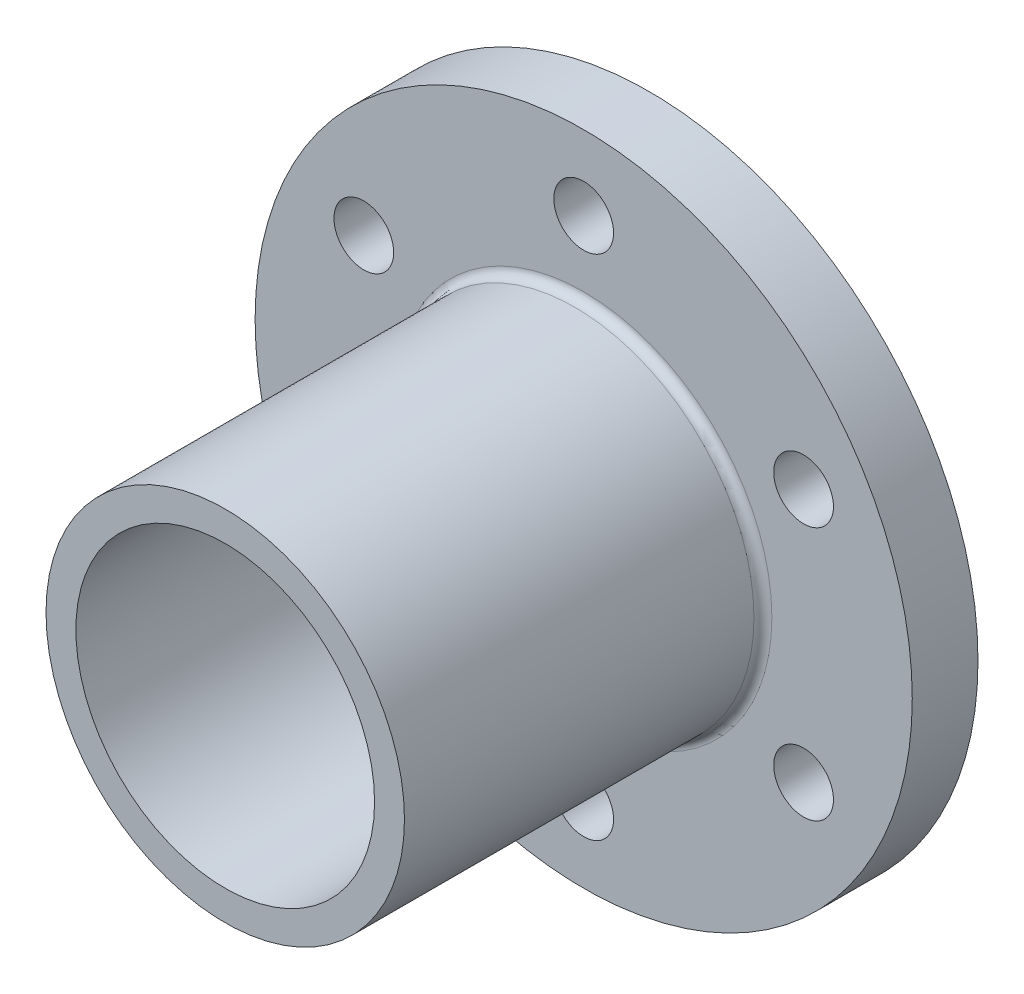
ISO-10303-21;
HEADER;
FILE_DESCRIPTION(('STEP AP214'),'2;1');
FILE_NAME('part.step','',(''),(''),'','','');
FILE_SCHEMA(('AUTOMOTIVE_DESIGN { 1 0 10303 214 1 1 1 1 }'));
ENDSEC;
DATA;
#1=APPLICATION_CONTEXT('core data for automotive mechanical design processes');
#2=APPLICATION_PROTOCOL_DEFINITION('international standard','automotive_design',2000,#1);
#3=PRODUCT_CONTEXT('',#1,'mechanical');
#4=PRODUCT('Part','Part','',(#3));
#5=PRODUCT_RELATED_PRODUCT_CATEGORY('part','',(#4));
#6=PRODUCT_DEFINITION_FORMATION('','',#4);
#7=PRODUCT_DEFINITION_CONTEXT('part definition',#1,'design');
#8=PRODUCT_DEFINITION('design','',#6,#7);
#9=PRODUCT_DEFINITION_SHAPE('','',#8);
#10=(LENGTH_UNIT() NAMED_UNIT(*) SI_UNIT(.MILLI.,.METRE.));
#11=(NAMED_UNIT(*) PLANE_ANGLE_UNIT() SI_UNIT($,.RADIAN.));
#12=(NAMED_UNIT(*) SI_UNIT($,.STERADIAN.) SOLID_ANGLE_UNIT());
#13=UNCERTAINTY_MEASURE_WITH_UNIT(LENGTH_MEASURE(1.E-05),#10,'distance_accuracy_value','');
#14=(GEOMETRIC_REPRESENTATION_CONTEXT(3) GLOBAL_UNCERTAINTY_ASSIGNED_CONTEXT((#13)) GLOBAL_UNIT_ASSIGNED_CONTEXT((#10,
#11,#12)) REPRESENTATION_CONTEXT('',''));
#15=CARTESIAN_POINT('',(0.,0.,0.));
#16=DIRECTION('',(0.,0.,1.));
#17=DIRECTION('',(1.,0.,0.));
#18=AXIS2_PLACEMENT_3D('',#15,#16,#17);
#19=CARTESIAN_POINT('',(0.,0.,22.));
#20=DIRECTION('',(0.,0.,-1.));
#21=DIRECTION('',(-1.,0.,0.));
#22=AXIS2_PLACEMENT_3D('',#19,#20,#21);
#23=CYLINDRICAL_SURFACE('',#22,110.);
#24=CARTESIAN_POINT('',(0.,0.,22.));
#25=DIRECTION('',(0.,0.,1.));
#26=DIRECTION('',(1.,0.,0.));
#27=AXIS2_PLACEMENT_3D('',#24,#25,#26);
#28=CIRCLE('',#27,110.);
#29=CARTESIAN_POINT('',(110.,0.,22.));
#30=VERTEX_POINT('',#29);
#31=EDGE_CURVE('E43',#30,#30,#28,.T.);
#32=ORIENTED_EDGE('',*,*,#31,.F.);
#33=EDGE_LOOP('',(#32));
#34=FACE_BOUND('',#33,.T.);
#35=CARTESIAN_POINT('',(0.,0.,0.));
#36=DIRECTION('',(0.,0.,1.));
#37=DIRECTION('',(1.,0.,0.));
#38=AXIS2_PLACEMENT_3D('',#35,#36,#37);
#39=CIRCLE('',#38,110.);
#40=CARTESIAN_POINT('',(110.,0.,0.));
#41=VERTEX_POINT('',#40);
#42=EDGE_CURVE('E47',#41,#41,#39,.T.);
#43=ORIENTED_EDGE('',*,*,#42,.T.);
#44=EDGE_LOOP('',(#43));
#45=FACE_BOUND('',#44,.T.);
#46=ADVANCED_FACE('F32',(#34,#45),#23,.T.);
#47=CARTESIAN_POINT('',(0.,0.,22.));
#48=DIRECTION('',(0.,0.,1.));
#49=DIRECTION('',(1.,0.,0.));
#50=AXIS2_PLACEMENT_3D('',#47,#48,#49);
#51=PLANE('',#50);
#52=CARTESIAN_POINT('',(0.,0.,22.));
#53=DIRECTION('',(0.,0.,1.));
#54=DIRECTION('',(1.,0.,0.));
#55=AXIS2_PLACEMENT_3D('',#52,#53,#54);
#56=CIRCLE('',#55,63.);
#57=CARTESIAN_POINT('',(63.,0.,22.));
#58=VERTEX_POINT('',#57);
#59=EDGE_CURVE('E10',#58,#58,#56,.F.);
#60=ORIENTED_EDGE('',*,*,#59,.T.);
#61=EDGE_LOOP('',(#60));
#62=FACE_BOUND('',#61,.T.);
#63=CARTESIAN_POINT('',(73.6121593216791,42.5000000000031,22.));
#64=DIRECTION('',(0.,0.,1.));
#65=DIRECTION('',(1.,0.,0.));
#66=AXIS2_PLACEMENT_3D('',#63,#64,#65);
#67=CIRCLE('',#66,10.000000000001);
#68=CARTESIAN_POINT('',(83.6121593216801,42.5000000000031,22.));
#69=VERTEX_POINT('',#68);
#70=EDGE_CURVE('E92',#69,#69,#67,.T.);
#71=ORIENTED_EDGE('',*,*,#70,.F.);
#72=EDGE_LOOP('',(#71));
#73=FACE_BOUND('',#72,.T.);
#74=CARTESIAN_POINT('',(73.6121593216827,-42.4999999999969,22.));
#75=DIRECTION('',(0.,0.,1.));
#76=DIRECTION('',(1.,0.,0.));
#77=AXIS2_PLACEMENT_3D('',#74,#75,#76);
#78=CIRCLE('',#77,10.0000000000047);
#79=CARTESIAN_POINT('',(83.6121593216874,-42.4999999999969,22.));
#80=VERTEX_POINT('',#79);
#81=EDGE_CURVE('E86',#80,#80,#78,.T.);
#82=ORIENTED_EDGE('',*,*,#81,.F.);
#83=EDGE_LOOP('',(#82));
#84=FACE_BOUND('',#83,.T.);
#85=CARTESIAN_POINT('',(7.22671690916752E-12,-85.,22.));
#86=DIRECTION('',(0.,0.,1.));
#87=DIRECTION('',(1.,0.,0.));
#88=AXIS2_PLACEMENT_3D('',#85,#86,#87);
#89=CIRCLE('',#88,10.0000000000075);
#90=CARTESIAN_POINT('',(10.0000000000147,-85.,22.));
#91=VERTEX_POINT('',#90);
#92=EDGE_CURVE('E80',#91,#91,#89,.T.);
#93=ORIENTED_EDGE('',*,*,#92,.F.);
#94=EDGE_LOOP('',(#93));
#95=FACE_BOUND('',#94,.T.);
#96=CARTESIAN_POINT('',(-73.6121593216719,-42.5000000000032,22.));
#97=DIRECTION('',(0.,0.,1.));
#98=DIRECTION('',(1.,0.,0.));
#99=AXIS2_PLACEMENT_3D('',#96,#97,#98);
#100=CIRCLE('',#99,10.0000000000069);
#101=CARTESIAN_POINT('',(-63.612159321665,-42.5000000000032,22.));
#102=VERTEX_POINT('',#101);
#103=EDGE_CURVE('E74',#102,#102,#100,.T.);
#104=ORIENTED_EDGE('',*,*,#103,.F.);
#105=EDGE_LOOP('',(#104));
#106=FACE_BOUND('',#105,.T.);
#107=CARTESIAN_POINT('',(-73.6121593216755,42.4999999999968,22.));
#108=DIRECTION('',(0.,0.,1.));
#109=DIRECTION('',(1.,0.,0.));
#110=AXIS2_PLACEMENT_3D('',#107,#108,#109);
#111=CIRCLE('',#110,10.0000000000036);
#112=CARTESIAN_POINT('',(-63.6121593216719,42.4999999999968,22.));
#113=VERTEX_POINT('',#112);
#114=EDGE_CURVE('E68',#113,#113,#111,.T.);
#115=ORIENTED_EDGE('',*,*,#114,.F.);
#116=EDGE_LOOP('',(#115));
#117=FACE_BOUND('',#116,.T.);
#118=CARTESIAN_POINT('',(0.,85.,22.));
#119=DIRECTION('',(0.,0.,1.));
#120=DIRECTION('',(1.,0.,0.));
#121=AXIS2_PLACEMENT_3D('',#118,#119,#120);
#122=CIRCLE('',#121,10.);
#123=CARTESIAN_POINT('',(10.,85.,22.));
#124=VERTEX_POINT('',#123);
#125=EDGE_CURVE('E62',#124,#124,#122,.T.);
#126=ORIENTED_EDGE('',*,*,#125,.F.);
#127=EDGE_LOOP('',(#126));
#128=FACE_BOUND('',#127,.T.);
#129=ORIENTED_EDGE('',*,*,#31,.T.);
#130=EDGE_LOOP('',(#129));
#131=FACE_BOUND('',#130,.T.);
#132=ADVANCED_FACE('F108',(#62,#73,#84,#95,#106,#117,#128,#131),#51,.T.);
#133=CARTESIAN_POINT('',(0.,0.,0.));
#134=DIRECTION('',(0.,0.,1.));
#135=DIRECTION('',(1.,0.,0.));
#136=AXIS2_PLACEMENT_3D('',#133,#134,#135);
#137=PLANE('',#136);
#138=CARTESIAN_POINT('',(73.6121593216791,42.5000000000031,0.));
#139=DIRECTION('',(0.,0.,1.));
#140=DIRECTION('',(1.,0.,0.));
#141=AXIS2_PLACEMENT_3D('',#138,#139,#140);
#142=CIRCLE('',#141,10.000000000001);
#143=CARTESIAN_POINT('',(83.6121593216801,42.5000000000031,0.));
#144=VERTEX_POINT('',#143);
#145=EDGE_CURVE('E65',#144,#144,#142,.T.);
#146=ORIENTED_EDGE('',*,*,#145,.T.);
#147=EDGE_LOOP('',(#146));
#148=FACE_BOUND('',#147,.T.);
#149=CARTESIAN_POINT('',(73.6121593216827,-42.4999999999969,0.));
#150=DIRECTION('',(0.,0.,1.));
#151=DIRECTION('',(1.,0.,0.));
#152=AXIS2_PLACEMENT_3D('',#149,#150,#151);
#153=CIRCLE('',#152,10.0000000000047);
#154=CARTESIAN_POINT('',(83.6121593216874,-42.4999999999969,0.));
#155=VERTEX_POINT('',#154);
#156=EDGE_CURVE('E89',#155,#155,#153,.T.);
#157=ORIENTED_EDGE('',*,*,#156,.T.);
#158=EDGE_LOOP('',(#157));
#159=FACE_BOUND('',#158,.T.);
#160=CARTESIAN_POINT('',(7.22671690916752E-12,-85.,0.));
#161=DIRECTION('',(0.,0.,1.));
#162=DIRECTION('',(1.,0.,0.));
#163=AXIS2_PLACEMENT_3D('',#160,#161,#162);
#164=CIRCLE('',#163,10.0000000000075);
#165=CARTESIAN_POINT('',(10.0000000000147,-85.,0.));
#166=VERTEX_POINT('',#165);
#167=EDGE_CURVE('E83',#166,#166,#164,.T.);
#168=ORIENTED_EDGE('',*,*,#167,.T.);
#169=EDGE_LOOP('',(#168));
#170=FACE_BOUND('',#169,.T.);
#171=CARTESIAN_POINT('',(-73.6121593216719,-42.5000000000032,0.));
#172=DIRECTION('',(0.,0.,1.));
#173=DIRECTION('',(1.,0.,0.));
#174=AXIS2_PLACEMENT_3D('',#171,#172,#173);
#175=CIRCLE('',#174,10.0000000000069);
#176=CARTESIAN_POINT('',(-63.612159321665,-42.5000000000032,0.));
#177=VERTEX_POINT('',#176);
#178=EDGE_CURVE('E77',#177,#177,#175,.T.);
#179=ORIENTED_EDGE('',*,*,#178,.T.);
#180=EDGE_LOOP('',(#179));
#181=FACE_BOUND('',#180,.T.);
#182=CARTESIAN_POINT('',(-73.6121593216755,42.4999999999968,0.));
#183=DIRECTION('',(0.,0.,1.));
#184=DIRECTION('',(1.,0.,0.));
#185=AXIS2_PLACEMENT_3D('',#182,#183,#184);
#186=CIRCLE('',#185,10.0000000000036);
#187=CARTESIAN_POINT('',(-63.6121593216719,42.4999999999968,0.));
#188=VERTEX_POINT('',#187);
#189=EDGE_CURVE('E71',#188,#188,#186,.T.);
#190=ORIENTED_EDGE('',*,*,#189,.T.);
#191=EDGE_LOOP('',(#190));
#192=FACE_BOUND('',#191,.T.);
#193=CARTESIAN_POINT('',(0.,85.,0.));
#194=DIRECTION('',(0.,0.,1.));
#195=DIRECTION('',(1.,0.,0.));
#196=AXIS2_PLACEMENT_3D('',#193,#194,#195);
#197=CIRCLE('',#196,10.);
#198=CARTESIAN_POINT('',(10.,85.,0.));
#199=VERTEX_POINT('',#198);
#200=EDGE_CURVE('E59',#199,#199,#197,.T.);
#201=ORIENTED_EDGE('',*,*,#200,.T.);
#202=EDGE_LOOP('',(#201));
#203=FACE_BOUND('',#202,.T.);
#204=CARTESIAN_POINT('',(0.,0.,0.));
#205=DIRECTION('',(0.,0.,1.));
#206=DIRECTION('',(1.,0.,0.));
#207=AXIS2_PLACEMENT_3D('',#204,#205,#206);
#208=CIRCLE('',#207,50.);
#209=CARTESIAN_POINT('',(50.,0.,0.));
#210=VERTEX_POINT('',#209);
#211=EDGE_CURVE('E55',#210,#210,#208,.T.);
#212=ORIENTED_EDGE('',*,*,#211,.T.);
#213=EDGE_LOOP('',(#212));
#214=FACE_BOUND('',#213,.T.);
#215=ORIENTED_EDGE('',*,*,#42,.F.);
#216=EDGE_LOOP('',(#215));
#217=FACE_BOUND('',#216,.T.);
#218=ADVANCED_FACE('F98',(#148,#159,#170,#181,#192,#203,#214,#217),#137,.F.);
#219=CARTESIAN_POINT('',(0.,0.,142.));
#220=DIRECTION('',(0.,0.,-1.));
#221=DIRECTION('',(-1.,0.,0.));
#222=AXIS2_PLACEMENT_3D('',#219,#220,#221);
#223=CYLINDRICAL_SURFACE('',#222,60.);
#224=CARTESIAN_POINT('',(0.,0.,25.));
#225=DIRECTION('',(0.,0.,1.));
#226=DIRECTION('',(1.,0.,0.));
#227=AXIS2_PLACEMENT_3D('',#224,#225,#226);
#228=CIRCLE('',#227,60.);
#229=CARTESIAN_POINT('',(60.,0.,25.));
#230=VERTEX_POINT('',#229);
#231=EDGE_CURVE('E39',#230,#230,#228,.T.);
#232=ORIENTED_EDGE('',*,*,#231,.T.);
#233=EDGE_LOOP('',(#232));
#234=FACE_BOUND('',#233,.T.);
#235=CARTESIAN_POINT('',(0.,0.,142.));
#236=DIRECTION('',(0.,0.,1.));
#237=DIRECTION('',(1.,0.,0.));
#238=AXIS2_PLACEMENT_3D('',#235,#236,#237);
#239=CIRCLE('',#238,60.);
#240=CARTESIAN_POINT('',(60.,0.,142.));
#241=VERTEX_POINT('',#240);
#242=EDGE_CURVE('E51',#241,#241,#239,.T.);
#243=ORIENTED_EDGE('',*,*,#242,.F.);
#244=EDGE_LOOP('',(#243));
#245=FACE_BOUND('',#244,.T.);
#246=ADVANCED_FACE('F129',(#234,#245),#223,.T.);
#247=CARTESIAN_POINT('',(0.,0.,142.));
#248=DIRECTION('',(0.,0.,1.));
#249=DIRECTION('',(1.,0.,0.));
#250=AXIS2_PLACEMENT_3D('',#247,#248,#249);
#251=PLANE('',#250);
#252=CARTESIAN_POINT('',(0.,0.,142.));
#253=DIRECTION('',(0.,0.,1.));
#254=DIRECTION('',(1.,0.,0.));
#255=AXIS2_PLACEMENT_3D('',#252,#253,#254);
#256=CIRCLE('',#255,50.);
#257=CARTESIAN_POINT('',(50.,0.,142.));
#258=VERTEX_POINT('',#257);
#259=EDGE_CURVE('E56',#258,#258,#256,.T.);
#260=ORIENTED_EDGE('',*,*,#259,.F.);
#261=EDGE_LOOP('',(#260));
#262=FACE_BOUND('',#261,.T.);
#263=ORIENTED_EDGE('',*,*,#242,.T.);
#264=EDGE_LOOP('',(#263));
#265=FACE_BOUND('',#264,.T.);
#266=ADVANCED_FACE('F134',(#262,#265),#251,.T.);
#267=CARTESIAN_POINT('',(0.,0.,0.));
#268=DIRECTION('',(0.,0.,1.));
#269=DIRECTION('',(1.,0.,0.));
#270=AXIS2_PLACEMENT_3D('',#267,#268,#269);
#271=CYLINDRICAL_SURFACE('',#270,50.);
#272=ORIENTED_EDGE('',*,*,#211,.F.);
#273=EDGE_LOOP('',(#272));
#274=FACE_BOUND('',#273,.T.);
#275=ORIENTED_EDGE('',*,*,#259,.T.);
#276=EDGE_LOOP('',(#275));
#277=FACE_BOUND('',#276,.T.);
#278=ADVANCED_FACE('F139',(#274,#277),#271,.F.);
#279=CARTESIAN_POINT('',(0.,85.,0.));
#280=DIRECTION('',(0.,0.,1.));
#281=DIRECTION('',(1.,0.,0.));
#282=AXIS2_PLACEMENT_3D('',#279,#280,#281);
#283=CYLINDRICAL_SURFACE('',#282,10.);
#284=ORIENTED_EDGE('',*,*,#200,.F.);
#285=EDGE_LOOP('',(#284));
#286=FACE_BOUND('',#285,.T.);
#287=ORIENTED_EDGE('',*,*,#125,.T.);
#288=EDGE_LOOP('',(#287));
#289=FACE_BOUND('',#288,.T.);
#290=ADVANCED_FACE('F143',(#286,#289),#283,.F.);
#291=CARTESIAN_POINT('',(-73.6121593216755,42.4999999999968,0.));
#292=DIRECTION('',(0.,0.,1.));
#293=DIRECTION('',(1.,0.,0.));
#294=AXIS2_PLACEMENT_3D('',#291,#292,#293);
#295=CYLINDRICAL_SURFACE('',#294,10.0000000000036);
#296=ORIENTED_EDGE('',*,*,#189,.F.);
#297=EDGE_LOOP('',(#296));
#298=FACE_BOUND('',#297,.T.);
#299=ORIENTED_EDGE('',*,*,#114,.T.);
#300=EDGE_LOOP('',(#299));
#301=FACE_BOUND('',#300,.T.);
#302=ADVANCED_FACE('F147',(#298,#301),#295,.F.);
#303=CARTESIAN_POINT('',(-73.6121593216719,-42.5000000000032,0.));
#304=DIRECTION('',(0.,0.,1.));
#305=DIRECTION('',(1.,0.,0.));
#306=AXIS2_PLACEMENT_3D('',#303,#304,#305);
#307=CYLINDRICAL_SURFACE('',#306,10.0000000000069);
#308=ORIENTED_EDGE('',*,*,#178,.F.);
#309=EDGE_LOOP('',(#308));
#310=FACE_BOUND('',#309,.T.);
#311=ORIENTED_EDGE('',*,*,#103,.T.);
#312=EDGE_LOOP('',(#311));
#313=FACE_BOUND('',#312,.T.);
#314=ADVANCED_FACE('F151',(#310,#313),#307,.F.);
#315=CARTESIAN_POINT('',(7.22671690916752E-12,-85.,0.));
#316=DIRECTION('',(0.,0.,1.));
#317=DIRECTION('',(1.,0.,0.));
#318=AXIS2_PLACEMENT_3D('',#315,#316,#317);
#319=CYLINDRICAL_SURFACE('',#318,10.0000000000075);
#320=ORIENTED_EDGE('',*,*,#167,.F.);
#321=EDGE_LOOP('',(#320));
#322=FACE_BOUND('',#321,.T.);
#323=ORIENTED_EDGE('',*,*,#92,.T.);
#324=EDGE_LOOP('',(#323));
#325=FACE_BOUND('',#324,.T.);
#326=ADVANCED_FACE('F155',(#322,#325),#319,.F.);
#327=CARTESIAN_POINT('',(73.6121593216827,-42.4999999999969,0.));
#328=DIRECTION('',(0.,0.,1.));
#329=DIRECTION('',(1.,0.,0.));
#330=AXIS2_PLACEMENT_3D('',#327,#328,#329);
#331=CYLINDRICAL_SURFACE('',#330,10.0000000000047);
#332=ORIENTED_EDGE('',*,*,#156,.F.);
#333=EDGE_LOOP('',(#332));
#334=FACE_BOUND('',#333,.T.);
#335=ORIENTED_EDGE('',*,*,#81,.T.);
#336=EDGE_LOOP('',(#335));
#337=FACE_BOUND('',#336,.T.);
#338=ADVANCED_FACE('F104',(#334,#337),#331,.F.);
#339=CARTESIAN_POINT('',(73.6121593216791,42.5000000000031,0.));
#340=DIRECTION('',(0.,0.,1.));
#341=DIRECTION('',(1.,0.,0.));
#342=AXIS2_PLACEMENT_3D('',#339,#340,#341);
#343=CYLINDRICAL_SURFACE('',#342,10.000000000001);
#344=ORIENTED_EDGE('',*,*,#145,.F.);
#345=EDGE_LOOP('',(#344));
#346=FACE_BOUND('',#345,.T.);
#347=ORIENTED_EDGE('',*,*,#70,.T.);
#348=EDGE_LOOP('',(#347));
#349=FACE_BOUND('',#348,.T.);
#350=ADVANCED_FACE('F101',(#346,#349),#343,.F.);
#351=CARTESIAN_POINT('',(0.,0.,25.));
#352=DIRECTION('',(0.,0.,1.));
#353=DIRECTION('',(1.,0.,0.));
#354=AXIS2_PLACEMENT_3D('',#351,#352,#353);
#355=TOROIDAL_SURFACE('',#354,63.,3.);
#356=ORIENTED_EDGE('',*,*,#59,.F.);
#357=EDGE_LOOP('',(#356));
#358=FACE_BOUND('',#357,.T.);
#359=ORIENTED_EDGE('',*,*,#231,.F.);
#360=EDGE_LOOP('',(#359));
#361=FACE_BOUND('',#360,.T.);
#362=ADVANCED_FACE('F34',(#358,#361),#355,.F.);
#363=CLOSED_SHELL('',(#46,#132,#218,#246,#266,#278,#290,#302,#314,#326,#338,#350,#362));
#364=MANIFOLD_SOLID_BREP('B2',#363);
#365=ADVANCED_BREP_SHAPE_REPRESENTATION('',(#18,#364),#14);
#366=SHAPE_DEFINITION_REPRESENTATION(#9,#365);
ENDSEC;
END-ISO-10303-21;
